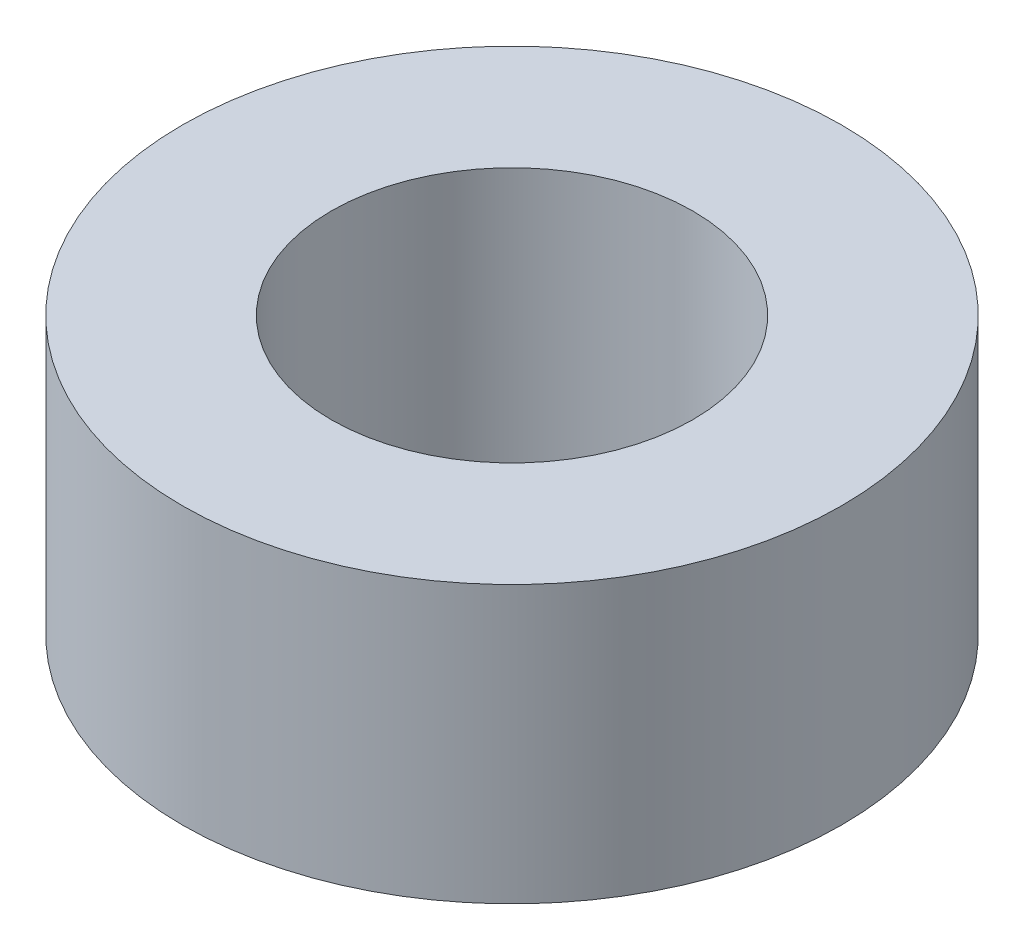
ISO-10303-21;
HEADER;
FILE_DESCRIPTION(('STEP AP214'),'2;1');
FILE_NAME('part.step','',(''),(''),'','','');
FILE_SCHEMA(('AUTOMOTIVE_DESIGN { 1 0 10303 214 1 1 1 1 }'));
ENDSEC;
DATA;
#1=APPLICATION_CONTEXT('core data for automotive mechanical design processes');
#2=APPLICATION_PROTOCOL_DEFINITION('international standard','automotive_design',2000,#1);
#3=PRODUCT_CONTEXT('',#1,'mechanical');
#4=PRODUCT('Part','Part','',(#3));
#5=PRODUCT_RELATED_PRODUCT_CATEGORY('part','',(#4));
#6=PRODUCT_DEFINITION_FORMATION('','',#4);
#7=PRODUCT_DEFINITION_CONTEXT('part definition',#1,'design');
#8=PRODUCT_DEFINITION('design','',#6,#7);
#9=PRODUCT_DEFINITION_SHAPE('','',#8);
#10=(LENGTH_UNIT() NAMED_UNIT(*) SI_UNIT(.MILLI.,.METRE.));
#11=(NAMED_UNIT(*) PLANE_ANGLE_UNIT() SI_UNIT($,.RADIAN.));
#12=(NAMED_UNIT(*) SI_UNIT($,.STERADIAN.) SOLID_ANGLE_UNIT());
#13=UNCERTAINTY_MEASURE_WITH_UNIT(LENGTH_MEASURE(1.E-05),#10,'distance_accuracy_value','');
#14=(GEOMETRIC_REPRESENTATION_CONTEXT(3) GLOBAL_UNCERTAINTY_ASSIGNED_CONTEXT((#13)) GLOBAL_UNIT_ASSIGNED_CONTEXT((#10,
#11,#12)) REPRESENTATION_CONTEXT('',''));
#15=CARTESIAN_POINT('',(0.,0.,0.));
#16=DIRECTION('',(0.,0.,1.));
#17=DIRECTION('',(1.,0.,0.));
#18=AXIS2_PLACEMENT_3D('',#15,#16,#17);
#19=CARTESIAN_POINT('',(0.,1.3,0.));
#20=DIRECTION('',(0.,1.,0.));
#21=DIRECTION('',(0.,0.,1.));
#22=AXIS2_PLACEMENT_3D('',#19,#20,#21);
#23=PLANE('',#22);
#24=CARTESIAN_POINT('',(0.,1.3,0.));
#25=DIRECTION('',(0.,1.,0.));
#26=DIRECTION('',(0.,0.,1.));
#27=AXIS2_PLACEMENT_3D('',#24,#25,#26);
#28=CIRCLE('',#27,3.1);
#29=CARTESIAN_POINT('',(0.,1.3,3.1));
#30=VERTEX_POINT('',#29);
#31=EDGE_CURVE('E10',#30,#30,#28,.T.);
#32=ORIENTED_EDGE('',*,*,#31,.T.);
#33=EDGE_LOOP('',(#32));
#34=FACE_BOUND('',#33,.T.);
#35=CARTESIAN_POINT('',(0.,1.3,0.));
#36=DIRECTION('',(0.,1.,0.));
#37=DIRECTION('',(0.,0.,1.));
#38=AXIS2_PLACEMENT_3D('',#35,#36,#37);
#39=CIRCLE('',#38,1.7);
#40=CARTESIAN_POINT('',(0.,1.3,1.7));
#41=VERTEX_POINT('',#40);
#42=EDGE_CURVE('E42',#41,#41,#39,.T.);
#43=ORIENTED_EDGE('',*,*,#42,.F.);
#44=EDGE_LOOP('',(#43));
#45=FACE_BOUND('',#44,.T.);
#46=ADVANCED_FACE('F31',(#34,#45),#23,.T.);
#47=CARTESIAN_POINT('',(0.,-1.3,0.));
#48=DIRECTION('',(0.,1.,0.));
#49=DIRECTION('',(0.,0.,1.));
#50=AXIS2_PLACEMENT_3D('',#47,#48,#49);
#51=PLANE('',#50);
#52=CARTESIAN_POINT('',(0.,-1.3,0.));
#53=DIRECTION('',(0.,1.,0.));
#54=DIRECTION('',(0.,0.,1.));
#55=AXIS2_PLACEMENT_3D('',#52,#53,#54);
#56=CIRCLE('',#55,3.1);
#57=CARTESIAN_POINT('',(0.,-1.3,3.1));
#58=VERTEX_POINT('',#57);
#59=EDGE_CURVE('E35',#58,#58,#56,.T.);
#60=ORIENTED_EDGE('',*,*,#59,.F.);
#61=EDGE_LOOP('',(#60));
#62=FACE_BOUND('',#61,.T.);
#63=CARTESIAN_POINT('',(0.,-1.3,0.));
#64=DIRECTION('',(0.,1.,0.));
#65=DIRECTION('',(0.,0.,1.));
#66=AXIS2_PLACEMENT_3D('',#63,#64,#65);
#67=CIRCLE('',#66,1.7);
#68=CARTESIAN_POINT('',(0.,-1.3,1.7));
#69=VERTEX_POINT('',#68);
#70=EDGE_CURVE('E44',#69,#69,#67,.T.);
#71=ORIENTED_EDGE('',*,*,#70,.T.);
#72=EDGE_LOOP('',(#71));
#73=FACE_BOUND('',#72,.T.);
#74=ADVANCED_FACE('F54',(#62,#73),#51,.F.);
#75=CARTESIAN_POINT('',(0.,1.3,0.));
#76=DIRECTION('',(0.,-1.,0.));
#77=DIRECTION('',(0.,0.,-1.));
#78=AXIS2_PLACEMENT_3D('',#75,#76,#77);
#79=CYLINDRICAL_SURFACE('',#78,3.1);
#80=ORIENTED_EDGE('',*,*,#31,.F.);
#81=EDGE_LOOP('',(#80));
#82=FACE_BOUND('',#81,.T.);
#83=ORIENTED_EDGE('',*,*,#59,.T.);
#84=EDGE_LOOP('',(#83));
#85=FACE_BOUND('',#84,.T.);
#86=ADVANCED_FACE('F33',(#82,#85),#79,.T.);
#87=CARTESIAN_POINT('',(0.,1.3,0.));
#88=DIRECTION('',(0.,-1.,0.));
#89=DIRECTION('',(0.,0.,-1.));
#90=AXIS2_PLACEMENT_3D('',#87,#88,#89);
#91=CYLINDRICAL_SURFACE('',#90,1.7);
#92=ORIENTED_EDGE('',*,*,#42,.T.);
#93=EDGE_LOOP('',(#92));
#94=FACE_BOUND('',#93,.T.);
#95=ORIENTED_EDGE('',*,*,#70,.F.);
#96=EDGE_LOOP('',(#95));
#97=FACE_BOUND('',#96,.T.);
#98=ADVANCED_FACE('F50',(#94,#97),#91,.F.);
#99=CLOSED_SHELL('',(#46,#74,#86,#98));
#100=MANIFOLD_SOLID_BREP('B2',#99);
#101=ADVANCED_BREP_SHAPE_REPRESENTATION('',(#18,#100),#14);
#102=SHAPE_DEFINITION_REPRESENTATION(#9,#101);
ENDSEC;
END-ISO-10303-21;
